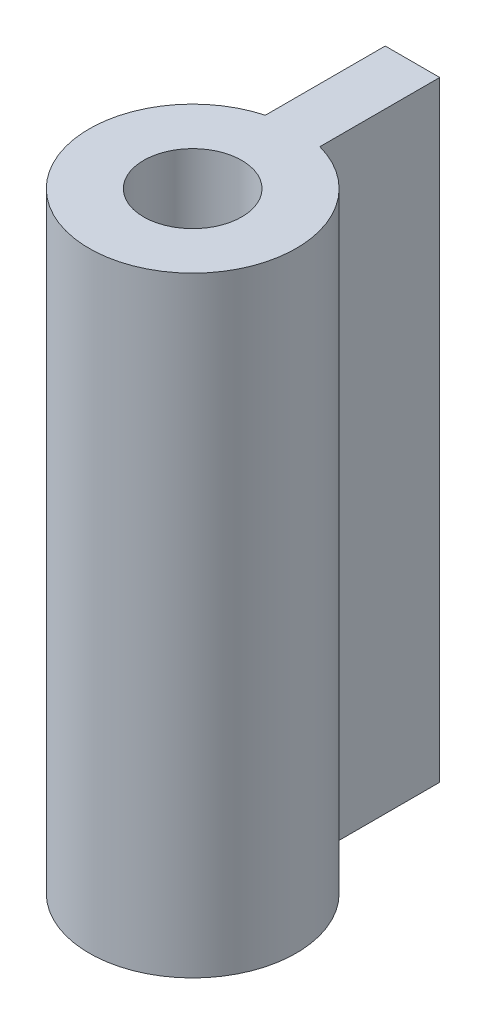
ISO-10303-21;
HEADER;
FILE_DESCRIPTION(('STEP AP214'),'2;1');
FILE_NAME('part.step','',(''),(''),'','','');
FILE_SCHEMA(('AUTOMOTIVE_DESIGN { 1 0 10303 214 1 1 1 1 }'));
ENDSEC;
DATA;
#1=APPLICATION_CONTEXT('core data for automotive mechanical design processes');
#2=APPLICATION_PROTOCOL_DEFINITION('international standard','automotive_design',2000,#1);
#3=PRODUCT_CONTEXT('',#1,'mechanical');
#4=PRODUCT('Part','Part','',(#3));
#5=PRODUCT_RELATED_PRODUCT_CATEGORY('part','',(#4));
#6=PRODUCT_DEFINITION_FORMATION('','',#4);
#7=PRODUCT_DEFINITION_CONTEXT('part definition',#1,'design');
#8=PRODUCT_DEFINITION('design','',#6,#7);
#9=PRODUCT_DEFINITION_SHAPE('','',#8);
#10=(LENGTH_UNIT() NAMED_UNIT(*) SI_UNIT(.MILLI.,.METRE.));
#11=(NAMED_UNIT(*) PLANE_ANGLE_UNIT() SI_UNIT($,.RADIAN.));
#12=(NAMED_UNIT(*) SI_UNIT($,.STERADIAN.) SOLID_ANGLE_UNIT());
#13=UNCERTAINTY_MEASURE_WITH_UNIT(LENGTH_MEASURE(1.E-05),#10,'distance_accuracy_value','');
#14=(GEOMETRIC_REPRESENTATION_CONTEXT(3) GLOBAL_UNCERTAINTY_ASSIGNED_CONTEXT((#13)) GLOBAL_UNIT_ASSIGNED_CONTEXT((#10,
#11,#12)) REPRESENTATION_CONTEXT('',''));
#15=CARTESIAN_POINT('',(0.,0.,0.));
#16=DIRECTION('',(0.,0.,1.));
#17=DIRECTION('',(1.,0.,0.));
#18=AXIS2_PLACEMENT_3D('',#15,#16,#17);
#19=CARTESIAN_POINT('',(-1.25,28.,0.));
#20=DIRECTION('',(1.,0.,0.));
#21=DIRECTION('',(0.,0.,-1.));
#22=AXIS2_PLACEMENT_3D('',#19,#20,#21);
#23=PLANE('',#22);
#24=DIRECTION('',(0.,0.,1.));
#25=VECTOR('',#24,1.);
#26=CARTESIAN_POINT('',(-1.25,0.,0.));
#27=LINE('',#26,#25);
#28=CARTESIAN_POINT('',(-1.25,0.,-10.0825756949558));
#29=VERTEX_POINT('',#28);
#30=CARTESIAN_POINT('',(-1.25,0.,-4.58257569495584));
#31=VERTEX_POINT('',#30);
#32=EDGE_CURVE('E112',#29,#31,#27,.T.);
#33=ORIENTED_EDGE('',*,*,#32,.T.);
#34=DIRECTION('',(0.,-1.,0.));
#35=VECTOR('',#34,1.);
#36=CARTESIAN_POINT('',(-1.25,28.,-4.58257569495584));
#37=LINE('',#36,#35);
#38=CARTESIAN_POINT('',(-1.25,28.,-4.58257569495584));
#39=VERTEX_POINT('',#38);
#40=EDGE_CURVE('E11',#39,#31,#37,.T.);
#41=ORIENTED_EDGE('',*,*,#40,.F.);
#42=DIRECTION('',(0.,0.,1.));
#43=VECTOR('',#42,1.);
#44=CARTESIAN_POINT('',(-1.25,28.,0.));
#45=LINE('',#44,#43);
#46=CARTESIAN_POINT('',(-1.25,28.,-10.0825756949558));
#47=VERTEX_POINT('',#46);
#48=EDGE_CURVE('E90',#47,#39,#45,.T.);
#49=ORIENTED_EDGE('',*,*,#48,.F.);
#50=DIRECTION('',(0.,-1.,0.));
#51=VECTOR('',#50,1.);
#52=CARTESIAN_POINT('',(-1.25,28.,-10.0825756949558));
#53=LINE('',#52,#51);
#54=EDGE_CURVE('E56',#47,#29,#53,.T.);
#55=ORIENTED_EDGE('',*,*,#54,.T.);
#56=EDGE_LOOP('',(#33,#41,#49,#55));
#57=FACE_BOUND('',#56,.T.);
#58=ADVANCED_FACE('F39',(#57),#23,.F.);
#59=CARTESIAN_POINT('',(0.,28.,0.));
#60=DIRECTION('',(0.,-1.,0.));
#61=DIRECTION('',(0.,0.,-1.));
#62=AXIS2_PLACEMENT_3D('',#59,#60,#61);
#63=CYLINDRICAL_SURFACE('',#62,4.75);
#64=CARTESIAN_POINT('',(0.,0.,0.));
#65=DIRECTION('',(0.,1.,0.));
#66=DIRECTION('',(0.,0.,1.));
#67=AXIS2_PLACEMENT_3D('',#64,#65,#66);
#68=CIRCLE('',#67,4.75);
#69=CARTESIAN_POINT('',(1.25,0.,-4.58257569495584));
#70=VERTEX_POINT('',#69);
#71=EDGE_CURVE('E96',#31,#70,#68,.T.);
#72=ORIENTED_EDGE('',*,*,#71,.T.);
#73=DIRECTION('',(0.,-1.,0.));
#74=VECTOR('',#73,1.);
#75=CARTESIAN_POINT('',(1.25,28.,-4.58257569495584));
#76=LINE('',#75,#74);
#77=CARTESIAN_POINT('',(1.25,28.,-4.58257569495584));
#78=VERTEX_POINT('',#77);
#79=EDGE_CURVE('E48',#78,#70,#76,.T.);
#80=ORIENTED_EDGE('',*,*,#79,.F.);
#81=CARTESIAN_POINT('',(0.,28.,0.));
#82=DIRECTION('',(0.,1.,0.));
#83=DIRECTION('',(0.,0.,1.));
#84=AXIS2_PLACEMENT_3D('',#81,#82,#83);
#85=CIRCLE('',#84,4.75);
#86=EDGE_CURVE('E81',#39,#78,#85,.T.);
#87=ORIENTED_EDGE('',*,*,#86,.F.);
#88=ORIENTED_EDGE('',*,*,#40,.T.);
#89=EDGE_LOOP('',(#72,#80,#87,#88));
#90=FACE_BOUND('',#89,.T.);
#91=ADVANCED_FACE('F95',(#90),#63,.T.);
#92=CARTESIAN_POINT('',(1.25,28.,0.));
#93=DIRECTION('',(1.,0.,0.));
#94=DIRECTION('',(0.,0.,-1.));
#95=AXIS2_PLACEMENT_3D('',#92,#93,#94);
#96=PLANE('',#95);
#97=DIRECTION('',(0.,0.,1.));
#98=VECTOR('',#97,1.);
#99=CARTESIAN_POINT('',(1.25,0.,0.));
#100=LINE('',#99,#98);
#101=CARTESIAN_POINT('',(1.25,0.,-10.0825756949558));
#102=VERTEX_POINT('',#101);
#103=EDGE_CURVE('E117',#102,#70,#100,.T.);
#104=ORIENTED_EDGE('',*,*,#103,.F.);
#105=DIRECTION('',(0.,-1.,0.));
#106=VECTOR('',#105,1.);
#107=CARTESIAN_POINT('',(1.25,28.,-10.0825756949558));
#108=LINE('',#107,#106);
#109=CARTESIAN_POINT('',(1.25,28.,-10.0825756949558));
#110=VERTEX_POINT('',#109);
#111=EDGE_CURVE('E70',#110,#102,#108,.T.);
#112=ORIENTED_EDGE('',*,*,#111,.F.);
#113=DIRECTION('',(0.,0.,1.));
#114=VECTOR('',#113,1.);
#115=CARTESIAN_POINT('',(1.25,28.,0.));
#116=LINE('',#115,#114);
#117=EDGE_CURVE('E89',#110,#78,#116,.T.);
#118=ORIENTED_EDGE('',*,*,#117,.T.);
#119=ORIENTED_EDGE('',*,*,#79,.T.);
#120=EDGE_LOOP('',(#104,#112,#118,#119));
#121=FACE_BOUND('',#120,.T.);
#122=ADVANCED_FACE('F100',(#121),#96,.T.);
#123=CARTESIAN_POINT('',(0.,28.,-10.0825756949558));
#124=DIRECTION('',(0.,0.,-1.));
#125=DIRECTION('',(-1.,0.,0.));
#126=AXIS2_PLACEMENT_3D('',#123,#124,#125);
#127=PLANE('',#126);
#128=DIRECTION('',(1.,0.,0.));
#129=VECTOR('',#128,1.);
#130=CARTESIAN_POINT('',(0.,0.,-10.0825756949558));
#131=LINE('',#130,#129);
#132=EDGE_CURVE('E120',#29,#102,#131,.T.);
#133=ORIENTED_EDGE('',*,*,#132,.F.);
#134=ORIENTED_EDGE('',*,*,#54,.F.);
#135=DIRECTION('',(1.,0.,0.));
#136=VECTOR('',#135,1.);
#137=CARTESIAN_POINT('',(0.,28.,-10.0825756949558));
#138=LINE('',#137,#136);
#139=EDGE_CURVE('E102',#47,#110,#138,.T.);
#140=ORIENTED_EDGE('',*,*,#139,.T.);
#141=ORIENTED_EDGE('',*,*,#111,.T.);
#142=EDGE_LOOP('',(#133,#134,#140,#141));
#143=FACE_BOUND('',#142,.T.);
#144=ADVANCED_FACE('F138',(#143),#127,.T.);
#145=CARTESIAN_POINT('',(0.,28.,0.));
#146=DIRECTION('',(0.,-1.,0.));
#147=DIRECTION('',(0.,0.,-1.));
#148=AXIS2_PLACEMENT_3D('',#145,#146,#147);
#149=CYLINDRICAL_SURFACE('',#148,2.25);
#150=CARTESIAN_POINT('',(0.,28.,0.));
#151=DIRECTION('',(0.,1.,0.));
#152=DIRECTION('',(0.,0.,1.));
#153=AXIS2_PLACEMENT_3D('',#150,#151,#152);
#154=CIRCLE('',#153,2.25);
#155=CARTESIAN_POINT('',(0.,28.,2.25));
#156=VERTEX_POINT('',#155);
#157=EDGE_CURVE('E105',#156,#156,#154,.T.);
#158=ORIENTED_EDGE('',*,*,#157,.T.);
#159=EDGE_LOOP('',(#158));
#160=FACE_BOUND('',#159,.T.);
#161=CARTESIAN_POINT('',(0.,0.,0.));
#162=DIRECTION('',(0.,1.,0.));
#163=DIRECTION('',(0.,0.,1.));
#164=AXIS2_PLACEMENT_3D('',#161,#162,#163);
#165=CIRCLE('',#164,2.25);
#166=CARTESIAN_POINT('',(0.,0.,2.25));
#167=VERTEX_POINT('',#166);
#168=EDGE_CURVE('E124',#167,#167,#165,.T.);
#169=ORIENTED_EDGE('',*,*,#168,.F.);
#170=EDGE_LOOP('',(#169));
#171=FACE_BOUND('',#170,.T.);
#172=ADVANCED_FACE('F136',(#160,#171),#149,.F.);
#173=CARTESIAN_POINT('',(0.,28.,0.));
#174=DIRECTION('',(0.,1.,0.));
#175=DIRECTION('',(0.,0.,1.));
#176=AXIS2_PLACEMENT_3D('',#173,#174,#175);
#177=PLANE('',#176);
#178=ORIENTED_EDGE('',*,*,#48,.T.);
#179=ORIENTED_EDGE('',*,*,#86,.T.);
#180=ORIENTED_EDGE('',*,*,#117,.F.);
#181=ORIENTED_EDGE('',*,*,#139,.F.);
#182=EDGE_LOOP('',(#178,#179,#180,#181));
#183=FACE_BOUND('',#182,.T.);
#184=ORIENTED_EDGE('',*,*,#157,.F.);
#185=EDGE_LOOP('',(#184));
#186=FACE_BOUND('',#185,.T.);
#187=ADVANCED_FACE('F85',(#183,#186),#177,.T.);
#188=CARTESIAN_POINT('',(0.,0.,0.));
#189=DIRECTION('',(0.,1.,0.));
#190=DIRECTION('',(0.,0.,1.));
#191=AXIS2_PLACEMENT_3D('',#188,#189,#190);
#192=PLANE('',#191);
#193=ORIENTED_EDGE('',*,*,#32,.F.);
#194=ORIENTED_EDGE('',*,*,#132,.T.);
#195=ORIENTED_EDGE('',*,*,#103,.T.);
#196=ORIENTED_EDGE('',*,*,#71,.F.);
#197=EDGE_LOOP('',(#193,#194,#195,#196));
#198=FACE_BOUND('',#197,.T.);
#199=ORIENTED_EDGE('',*,*,#168,.T.);
#200=EDGE_LOOP('',(#199));
#201=FACE_BOUND('',#200,.T.);
#202=ADVANCED_FACE('F134',(#198,#201),#192,.F.);
#203=CLOSED_SHELL('',(#58,#91,#122,#144,#172,#187,#202));
#204=MANIFOLD_SOLID_BREP('B2',#203);
#205=ADVANCED_BREP_SHAPE_REPRESENTATION('',(#18,#204),#14);
#206=SHAPE_DEFINITION_REPRESENTATION(#9,#205);
ENDSEC;
END-ISO-10303-21;
